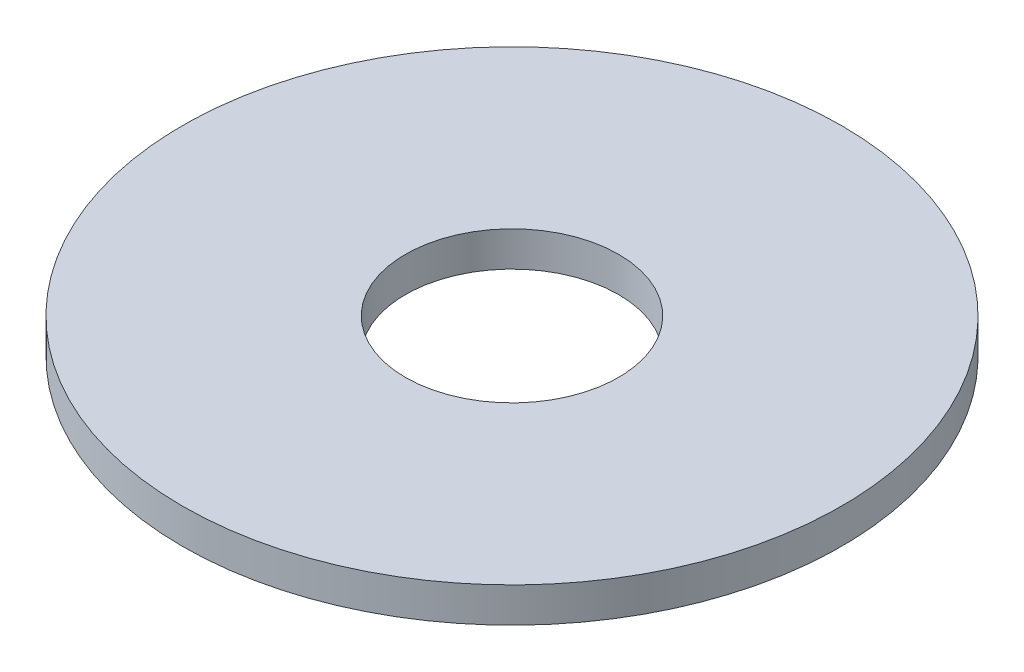
ISO-10303-21;
HEADER;
FILE_DESCRIPTION(('STEP AP214'),'2;1');
FILE_NAME('part.step','',(''),(''),'','','');
FILE_SCHEMA(('AUTOMOTIVE_DESIGN { 1 0 10303 214 1 1 1 1 }'));
ENDSEC;
DATA;
#1=APPLICATION_CONTEXT('core data for automotive mechanical design processes');
#2=APPLICATION_PROTOCOL_DEFINITION('international standard','automotive_design',2000,#1);
#3=PRODUCT_CONTEXT('',#1,'mechanical');
#4=PRODUCT('Part','Part','',(#3));
#5=PRODUCT_RELATED_PRODUCT_CATEGORY('part','',(#4));
#6=PRODUCT_DEFINITION_FORMATION('','',#4);
#7=PRODUCT_DEFINITION_CONTEXT('part definition',#1,'design');
#8=PRODUCT_DEFINITION('design','',#6,#7);
#9=PRODUCT_DEFINITION_SHAPE('','',#8);
#10=(LENGTH_UNIT() NAMED_UNIT(*) SI_UNIT(.MILLI.,.METRE.));
#11=(NAMED_UNIT(*) PLANE_ANGLE_UNIT() SI_UNIT($,.RADIAN.));
#12=(NAMED_UNIT(*) SI_UNIT($,.STERADIAN.) SOLID_ANGLE_UNIT());
#13=UNCERTAINTY_MEASURE_WITH_UNIT(LENGTH_MEASURE(1.E-05),#10,'distance_accuracy_value','');
#14=(GEOMETRIC_REPRESENTATION_CONTEXT(3) GLOBAL_UNCERTAINTY_ASSIGNED_CONTEXT((#13)) GLOBAL_UNIT_ASSIGNED_CONTEXT((#10,
#11,#12)) REPRESENTATION_CONTEXT('',''));
#15=CARTESIAN_POINT('',(0.,0.,0.));
#16=DIRECTION('',(0.,0.,1.));
#17=DIRECTION('',(1.,0.,0.));
#18=AXIS2_PLACEMENT_3D('',#15,#16,#17);
#19=CARTESIAN_POINT('',(0.,9.,0.));
#20=DIRECTION('',(0.,-1.,0.));
#21=DIRECTION('',(0.,0.,-1.));
#22=AXIS2_PLACEMENT_3D('',#19,#20,#21);
#23=CYLINDRICAL_SURFACE('',#22,85.);
#24=CARTESIAN_POINT('',(0.,9.,0.));
#25=DIRECTION('',(0.,1.,0.));
#26=DIRECTION('',(0.,0.,1.));
#27=AXIS2_PLACEMENT_3D('',#24,#25,#26);
#28=CIRCLE('',#27,85.);
#29=CARTESIAN_POINT('',(0.,9.,85.));
#30=VERTEX_POINT('',#29);
#31=EDGE_CURVE('E10',#30,#30,#28,.T.);
#32=ORIENTED_EDGE('',*,*,#31,.F.);
#33=EDGE_LOOP('',(#32));
#34=FACE_BOUND('',#33,.T.);
#35=CARTESIAN_POINT('',(0.,0.,0.));
#36=DIRECTION('',(0.,1.,0.));
#37=DIRECTION('',(0.,0.,1.));
#38=AXIS2_PLACEMENT_3D('',#35,#36,#37);
#39=CIRCLE('',#38,85.);
#40=CARTESIAN_POINT('',(0.,0.,85.));
#41=VERTEX_POINT('',#40);
#42=EDGE_CURVE('E37',#41,#41,#39,.T.);
#43=ORIENTED_EDGE('',*,*,#42,.T.);
#44=EDGE_LOOP('',(#43));
#45=FACE_BOUND('',#44,.T.);
#46=ADVANCED_FACE('F40',(#34,#45),#23,.T.);
#47=CARTESIAN_POINT('',(0.,9.,0.));
#48=DIRECTION('',(0.,1.,0.));
#49=DIRECTION('',(0.,0.,1.));
#50=AXIS2_PLACEMENT_3D('',#47,#48,#49);
#51=PLANE('',#50);
#52=CARTESIAN_POINT('',(0.,9.,0.));
#53=DIRECTION('',(0.,1.,0.));
#54=DIRECTION('',(0.,0.,1.));
#55=AXIS2_PLACEMENT_3D('',#52,#53,#54);
#56=CIRCLE('',#55,27.5);
#57=CARTESIAN_POINT('',(0.,9.,27.5));
#58=VERTEX_POINT('',#57);
#59=EDGE_CURVE('E50',#58,#58,#56,.T.);
#60=ORIENTED_EDGE('',*,*,#59,.F.);
#61=EDGE_LOOP('',(#60));
#62=FACE_BOUND('',#61,.T.);
#63=ORIENTED_EDGE('',*,*,#31,.T.);
#64=EDGE_LOOP('',(#63));
#65=FACE_BOUND('',#64,.T.);
#66=ADVANCED_FACE('F59',(#62,#65),#51,.T.);
#67=CARTESIAN_POINT('',(0.,0.,0.));
#68=DIRECTION('',(0.,1.,0.));
#69=DIRECTION('',(0.,0.,1.));
#70=AXIS2_PLACEMENT_3D('',#67,#68,#69);
#71=PLANE('',#70);
#72=CARTESIAN_POINT('',(0.,0.,0.));
#73=DIRECTION('',(0.,1.,0.));
#74=DIRECTION('',(0.,0.,1.));
#75=AXIS2_PLACEMENT_3D('',#72,#73,#74);
#76=CIRCLE('',#75,27.5);
#77=CARTESIAN_POINT('',(0.,0.,27.5));
#78=VERTEX_POINT('',#77);
#79=EDGE_CURVE('E47',#78,#78,#76,.T.);
#80=ORIENTED_EDGE('',*,*,#79,.T.);
#81=EDGE_LOOP('',(#80));
#82=FACE_BOUND('',#81,.T.);
#83=ORIENTED_EDGE('',*,*,#42,.F.);
#84=EDGE_LOOP('',(#83));
#85=FACE_BOUND('',#84,.T.);
#86=ADVANCED_FACE('F58',(#82,#85),#71,.F.);
#87=CARTESIAN_POINT('',(0.,9.,0.));
#88=DIRECTION('',(0.,-1.,0.));
#89=DIRECTION('',(0.,0.,-1.));
#90=AXIS2_PLACEMENT_3D('',#87,#88,#89);
#91=CYLINDRICAL_SURFACE('',#90,27.5);
#92=ORIENTED_EDGE('',*,*,#59,.T.);
#93=EDGE_LOOP('',(#92));
#94=FACE_BOUND('',#93,.T.);
#95=ORIENTED_EDGE('',*,*,#79,.F.);
#96=EDGE_LOOP('',(#95));
#97=FACE_BOUND('',#96,.T.);
#98=ADVANCED_FACE('F54',(#94,#97),#91,.F.);
#99=CLOSED_SHELL('',(#46,#66,#86,#98));
#100=MANIFOLD_SOLID_BREP('B2',#99);
#101=ADVANCED_BREP_SHAPE_REPRESENTATION('',(#18,#100),#14);
#102=SHAPE_DEFINITION_REPRESENTATION(#9,#101);
ENDSEC;
END-ISO-10303-21;
